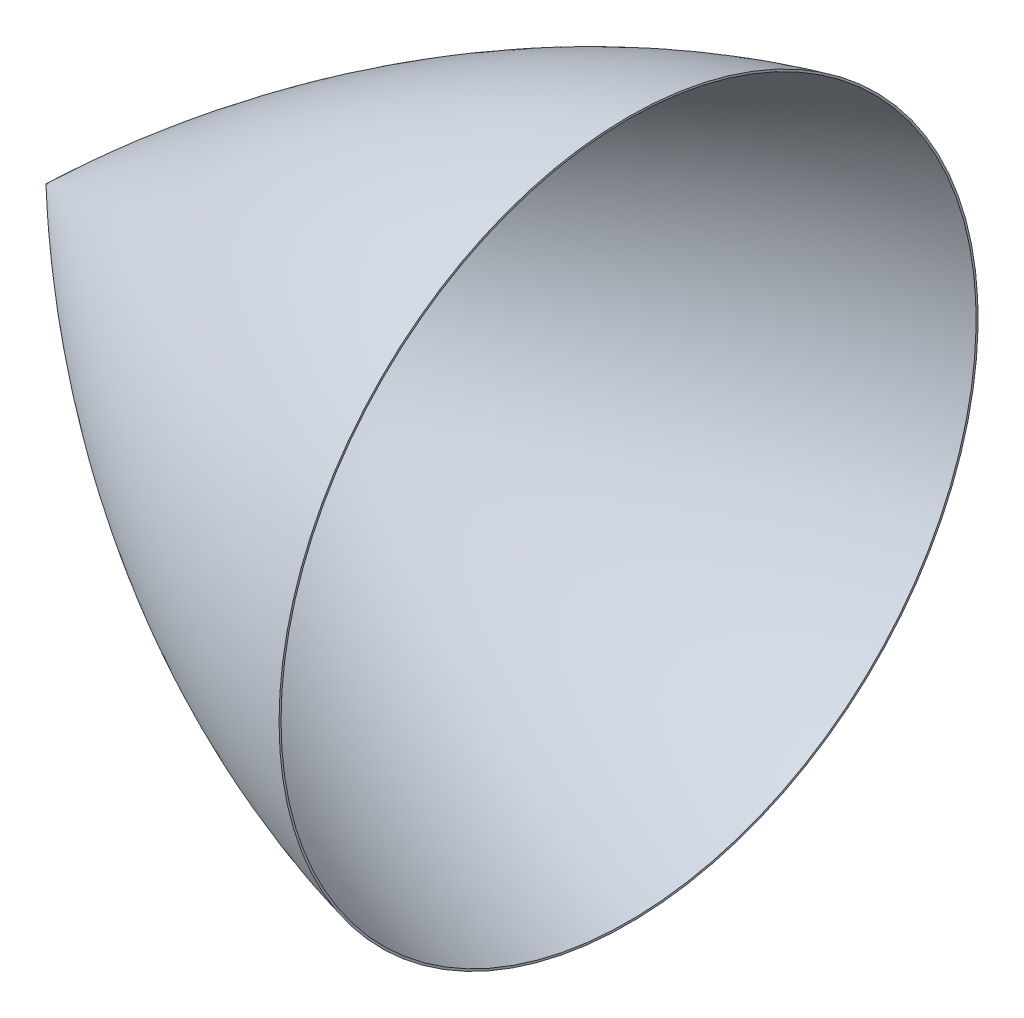
ISO-10303-21;
HEADER;
FILE_DESCRIPTION(('STEP AP214'),'2;1');
FILE_NAME('part.step','',(''),(''),'','','');
FILE_SCHEMA(('AUTOMOTIVE_DESIGN { 1 0 10303 214 1 1 1 1 }'));
ENDSEC;
DATA;
#1=APPLICATION_CONTEXT('core data for automotive mechanical design processes');
#2=APPLICATION_PROTOCOL_DEFINITION('international standard','automotive_design',2000,#1);
#3=PRODUCT_CONTEXT('',#1,'mechanical');
#4=PRODUCT('Part','Part','',(#3));
#5=PRODUCT_RELATED_PRODUCT_CATEGORY('part','',(#4));
#6=PRODUCT_DEFINITION_FORMATION('','',#4);
#7=PRODUCT_DEFINITION_CONTEXT('part definition',#1,'design');
#8=PRODUCT_DEFINITION('design','',#6,#7);
#9=PRODUCT_DEFINITION_SHAPE('','',#8);
#10=(LENGTH_UNIT() NAMED_UNIT(*) SI_UNIT(.MILLI.,.METRE.));
#11=(NAMED_UNIT(*) PLANE_ANGLE_UNIT() SI_UNIT($,.RADIAN.));
#12=(NAMED_UNIT(*) SI_UNIT($,.STERADIAN.) SOLID_ANGLE_UNIT());
#13=UNCERTAINTY_MEASURE_WITH_UNIT(LENGTH_MEASURE(1.E-05),#10,'distance_accuracy_value','');
#14=(GEOMETRIC_REPRESENTATION_CONTEXT(3) GLOBAL_UNCERTAINTY_ASSIGNED_CONTEXT((#13)) GLOBAL_UNIT_ASSIGNED_CONTEXT((#10,
#11,#12)) REPRESENTATION_CONTEXT('',''));
#15=CARTESIAN_POINT('',(0.,0.,0.));
#16=DIRECTION('',(0.,0.,1.));
#17=DIRECTION('',(1.,0.,0.));
#18=AXIS2_PLACEMENT_3D('',#15,#16,#17);
#19=CARTESIAN_POINT('',(7619.99999999521,0.,0.));
#20=DIRECTION('',(-1.,0.,0.));
#21=DIRECTION('',(0.,0.,1.));
#22=AXIS2_PLACEMENT_3D('',#19,#20,#21);
#23=PLANE('',#22);
#24=CARTESIAN_POINT('',(7619.99999999528,0.,0.));
#25=DIRECTION('',(-1.,0.,0.));
#26=DIRECTION('',(0.,0.,1.));
#27=AXIS2_PLACEMENT_3D('',#24,#25,#26);
#28=CIRCLE('',#27,4545.8767577942);
#29=CARTESIAN_POINT('',(7619.99999999528,0.,4545.8767577942));
#30=VERTEX_POINT('',#29);
#31=EDGE_CURVE('E46',#30,#30,#28,.T.);
#32=ORIENTED_EDGE('',*,*,#31,.T.);
#33=EDGE_LOOP('',(#32));
#34=FACE_BOUND('',#33,.T.);
#35=CARTESIAN_POINT('',(7619.99999999521,0.,0.));
#36=DIRECTION('',(-1.,0.,0.));
#37=DIRECTION('',(0.,0.,1.));
#38=AXIS2_PLACEMENT_3D('',#35,#36,#37);
#39=CIRCLE('',#38,4572.);
#40=CARTESIAN_POINT('',(7619.99999999521,0.,4572.));
#41=VERTEX_POINT('',#40);
#42=EDGE_CURVE('E11',#41,#41,#39,.T.);
#43=ORIENTED_EDGE('',*,*,#42,.F.);
#44=EDGE_LOOP('',(#43));
#45=FACE_BOUND('',#44,.T.);
#46=ADVANCED_FACE('F39',(#34,#45),#23,.F.);
#47=CARTESIAN_POINT('',(1.01347657407796E-10,9.72933347824889E-11,0.));
#48=CARTESIAN_POINT('',(1.87740134786748,1.80230529395431,0.));
#49=CARTESIAN_POINT('',(5.5244526539301,5.30222639472966,0.));
#50=CARTESIAN_POINT('',(14.1169653702769,13.5454195533115,0.));
#51=CARTESIAN_POINT('',(22.0000547897217,21.0981902356204,0.));
#52=CARTESIAN_POINT('',(33.5446059496773,32.1528246928488,0.));
#53=CARTESIAN_POINT('',(46.708752927163,44.7416001061948,0.));
#54=CARTESIAN_POINT('',(62.4544573584839,59.7785555314608,0.));
#55=CARTESIAN_POINT('',(80.247464828274,76.7394260742745,0.));
#56=CARTESIAN_POINT('',(98.1670521370055,93.7915154288754,0.));
#57=CARTESIAN_POINT('',(116.042598820677,110.770951283337,0.));
#58=CARTESIAN_POINT('',(138.440778852595,132.008778807169,0.));
#59=CARTESIAN_POINT('',(165.331937213061,157.445923634877,0.));
#60=CARTESIAN_POINT('',(205.73609333592,195.551446100835,0.));
#61=CARTESIAN_POINT('',(259.72476904635,246.224218395045,0.));
#62=CARTESIAN_POINT('',(322.893056261337,305.154619186948,0.));
#63=CARTESIAN_POINT('',(395.330018942636,372.236871871071,0.));
#64=CARTESIAN_POINT('',(468.015884271906,439.051317599152,0.));
#65=CARTESIAN_POINT('',(540.950720151817,505.592832232719,0.));
#66=CARTESIAN_POINT('',(614.136956836665,571.858500337153,0.));
#67=CARTESIAN_POINT('',(687.575555579447,637.843939225251,0.));
#68=CARTESIAN_POINT('',(761.268377960242,703.545567704155,0.));
#69=CARTESIAN_POINT('',(835.216769664103,768.959248033079,0.));
#70=CARTESIAN_POINT('',(909.422380671881,834.081073956153,0.));
#71=CARTESIAN_POINT('',(983.886674254546,898.906897859622,0.));
#72=CARTESIAN_POINT('',(1133.33575317751,1027.95831758016,0.));
#73=CARTESIAN_POINT('',(1321.67385467313,1187.4971391804,0.));
#74=CARTESIAN_POINT('',(1550.07598932804,1376.08879786686,0.));
#75=CARTESIAN_POINT('',(1800.75357842844,1576.39453771898,0.));
#76=CARTESIAN_POINT('',(1995.42410726054,1728.13949209819,0.));
#77=CARTESIAN_POINT('',(2172.09539122916,1862.80296231837,0.));
#78=CARTESIAN_POINT('',(2330.26515401322,1981.00871220136,0.));
#79=CARTESIAN_POINT('',(2489.57332050041,2097.67583412369,0.));
#80=CARTESIAN_POINT('',(2650.02924293696,2212.75955408681,0.));
#81=CARTESIAN_POINT('',(2811.64170311988,2326.21376290127,0.));
#82=CARTESIAN_POINT('',(2974.41868643201,2437.9908972045,0.));
#83=CARTESIAN_POINT('',(3138.36768573033,2548.04219087629,0.));
#84=CARTESIAN_POINT('',(3303.49527751566,2656.31743223421,0.));
#85=CARTESIAN_POINT('',(3491.92163639092,2776.91938159409,0.));
#86=CARTESIAN_POINT('',(3702.8978890566,2908.04217997174,0.));
#87=CARTESIAN_POINT('',(3937.05658063922,3048.57113731965,0.));
#88=CARTESIAN_POINT('',(4195.10534952983,3197.1672226111,0.));
#89=CARTESIAN_POINT('',(4454.48195194503,3340.2040699311,0.));
#90=CARTESIAN_POINT('',(4716.54224967053,3478.26494797615,0.));
#91=CARTESIAN_POINT('',(4981.26983493948,3611.14237076973,0.));
#92=CARTESIAN_POINT('',(5248.63892094148,3738.62410879923,0.));
#93=CARTESIAN_POINT('',(5518.61352060052,3860.49405812309,0.));
#94=CARTESIAN_POINT('',(5791.14648750829,3976.53322279501,0.));
#95=CARTESIAN_POINT('',(6066.17879880503,4086.52097738576,0.));
#96=CARTESIAN_POINT('',(6343.63869164902,4190.23643015886,0.));
#97=CARTESIAN_POINT('',(6588.46556626651,4275.30702321407,0.));
#98=CARTESIAN_POINT('',(6787.98281826292,4340.21389556613,0.));
#99=CARTESIAN_POINT('',(6929.4779090228,4383.93229610803,0.));
#100=CARTESIAN_POINT('',(7012.22154666975,4408.75863971695,0.));
#101=CARTESIAN_POINT('',(7071.42024270652,4426.1674364486,0.));
#102=CARTESIAN_POINT('',(7118.83618731631,4439.89892438963,0.));
#103=CARTESIAN_POINT('',(7166.30855851103,4453.43393704218,0.));
#104=CARTESIAN_POINT('',(7213.83677974541,4466.77155627866,0.));
#105=CARTESIAN_POINT('',(7261.42028906431,4479.9108730655,0.));
#106=CARTESIAN_POINT('',(7303.10357605428,4491.23343362137,0.));
#107=CARTESIAN_POINT('',(7338.86595752091,4500.81342912991,0.));
#108=CARTESIAN_POINT('',(7368.69003656812,4508.71304181715,0.));
#109=CARTESIAN_POINT('',(7392.56289350955,4514.98249065609,0.));
#110=CARTESIAN_POINT('',(7416.44828381828,4521.20135148719,0.));
#111=CARTESIAN_POINT('',(7440.34787298326,4527.36993347933,0.));
#112=CARTESIAN_POINT('',(7464.25854379477,4533.48739866174,0.));
#113=CARTESIAN_POINT('',(7488.18535193785,4539.5548712777,0.));
#114=CARTESIAN_POINT('',(7512.11940509445,4545.57012890112,0.));
#115=CARTESIAN_POINT('',(7533.08200574404,4550.79106594278,0.));
#116=CARTESIAN_POINT('',(7551.04286900422,4555.23062519298,0.));
#117=CARTESIAN_POINT('',(7566.04087019449,4558.91502495668,0.));
#118=CARTESIAN_POINT('',(7577.98815065165,4561.83671678102,0.));
#119=CARTESIAN_POINT('',(7588.57119988449,4564.4123265026,0.));
#120=CARTESIAN_POINT('',(7597.42410759232,4566.55911765531,0.));
#121=CARTESIAN_POINT('',(7604.18164795769,4568.19240168305,0.));
#122=CARTESIAN_POINT('',(7608.98379440809,4569.35044238275,0.));
#123=CARTESIAN_POINT('',(7613.80970477411,4570.51248672083,0.));
#124=CARTESIAN_POINT('',(7616.83342995595,4571.23959797744,0.));
#125=CARTESIAN_POINT('',(7618.73469301098,4571.69632632377,0.));
#126=CARTESIAN_POINT('',(7619.99999999523,4571.99999999999,0.));
#127=B_SPLINE_CURVE_WITH_KNOTS('',4,(#47,#48,#49,#50,#51,#52,#53,#54,#55,#56,#57,#58,#59,#60,
#61,#62,#63,#64,#65,#66,#67,#68,#69,#70,#71,#72,#73,#74,#75,#76,#77,#78,#79,#80,#81,#82,#83,#84,
#85,#86,#87,#88,#89,#90,#91,#92,#93,#94,#95,#96,#97,#98,#99,#100,#101,#102,#103,#104,#105,#106,
#107,#108,#109,#110,#111,#112,#113,#114,#115,#116,#117,#118,#119,#120,#121,#122,#123,#124,#125,
#126),.UNSPECIFIED.,.F.,.F.,(5,1,1,1,1,1,1,1,1,1,1,1,1,1,1,1,1,1,1,1,1,1,1,1,1,1,1,1,1,1,1,1,1,
1,1,1,1,1,1,1,1,1,1,1,1,1,1,1,1,1,1,1,1,1,1,1,1,1,1,1,1,1,1,1,1,1,1,1,1,1,1,1,1,1,1,1,5),
(0.0834980457108315,0.0846559203269954,0.0858137949431592,0.086971669559323,0.0881295441754869,
0.0904452934078145,0.0927610426401422,0.0950767918724698,0.0973925411047975,0.0997082903371252,
0.102024039569453,0.106655532026717,0.11128702448398,0.120550009398508,0.129812978245726,
0.139075947092944,0.148338934756868,0.157601922420792,0.166864908117926,0.176127893815061,
0.185390873525411,0.194653853235761,0.203916833911034,0.213179814586307,0.222442794179272,
0.268757694269802,0.296546618715655,0.32433557784179,0.342861538091348,0.3613874891421,
0.3799134344904,0.398439420103946,0.416965364680518,0.435491317107001,0.45401728312301,
0.472543239623733,0.491069208014046,0.509595182049545,0.537974754515422,0.565763707674729,
0.593552619712825,0.621341571792014,0.649130524853596,0.676919468746946,0.704708387151255,
0.73249733975273,0.760286295766909,0.788075221712798,0.81586413356906,0.843653094793508,
0.857547562742245,0.866810560631531,0.871442058355402,0.87607353986269,0.880705021369979,
0.885336501719254,0.88996798206853,0.894599477686182,0.899230973303835,0.901546723936096,
0.903862474568358,0.906178225200619,0.90849397583288,0.910809717042354,0.913125458251828,
0.915441199461301,0.917756940670775,0.920072679227726,0.921230548506201,0.922388417784676,
0.923546287063151,0.924704156341627,0.925283090980864,0.925862025620102,0.926151492939721,
0.92644096025934,0.927019894898577),.UNSPECIFIED.);
#128=CARTESIAN_POINT('',(0.,0.,0.));
#129=DIRECTION('',(-1.,0.,0.));
#130=AXIS1_PLACEMENT('',#128,#129);
#131=SURFACE_OF_REVOLUTION('',#127,#130);
#132=ORIENTED_EDGE('',*,*,#42,.T.);
#133=EDGE_LOOP('',(#132));
#134=FACE_BOUND('',#133,.T.);
#135=CARTESIAN_POINT('',(1.01347657407796E-10,9.72933347824889E-11,0.));
#136=VERTEX_POINT('',#135);
#137=VERTEX_LOOP('',#136);
#138=FACE_BOUND('',#137,.T.);
#139=ADVANCED_FACE('F55',(#134,#138),#131,.F.);
#140=CARTESIAN_POINT('',(19.1222361643196,18.340283029739,0.));
#141=CARTESIAN_POINT('',(20.9839847029081,20.1240964529545,0.));
#142=CARTESIAN_POINT('',(24.926165842535,23.9001132964018,0.));
#143=CARTESIAN_POINT('',(33.8380953384452,32.4334864028493,0.));
#144=CARTESIAN_POINT('',(46.708752927163,44.7416001061948,0.));
#145=CARTESIAN_POINT('',(62.4544573584839,59.7785555314608,0.));
#146=CARTESIAN_POINT('',(80.247464828274,76.7394260742745,0.));
#147=CARTESIAN_POINT('',(98.1670521370055,93.7915154288754,0.));
#148=CARTESIAN_POINT('',(116.042598820677,110.770951283337,0.));
#149=CARTESIAN_POINT('',(138.440778852595,132.008778807169,0.));
#150=CARTESIAN_POINT('',(165.331937213061,157.445923634877,0.));
#151=CARTESIAN_POINT('',(205.73609333592,195.551446100835,0.));
#152=CARTESIAN_POINT('',(259.72476904635,246.224218395045,0.));
#153=CARTESIAN_POINT('',(322.893056261337,305.154619186948,0.));
#154=CARTESIAN_POINT('',(395.330018942636,372.236871871071,0.));
#155=CARTESIAN_POINT('',(468.015884271906,439.051317599152,0.));
#156=CARTESIAN_POINT('',(540.950720151817,505.592832232719,0.));
#157=CARTESIAN_POINT('',(614.136956836665,571.858500337153,0.));
#158=CARTESIAN_POINT('',(687.575555579447,637.843939225251,0.));
#159=CARTESIAN_POINT('',(761.268377960242,703.545567704155,0.));
#160=CARTESIAN_POINT('',(835.216769664103,768.959248033079,0.));
#161=CARTESIAN_POINT('',(909.422380671881,834.081073956153,0.));
#162=CARTESIAN_POINT('',(983.886674254546,898.906897859622,0.));
#163=CARTESIAN_POINT('',(1133.33575317751,1027.95831758016,0.));
#164=CARTESIAN_POINT('',(1321.67385467313,1187.4971391804,0.));
#165=CARTESIAN_POINT('',(1550.07598932804,1376.08879786686,0.));
#166=CARTESIAN_POINT('',(1800.75357842844,1576.39453771898,0.));
#167=CARTESIAN_POINT('',(1995.42410726054,1728.13949209819,0.));
#168=CARTESIAN_POINT('',(2172.09539122916,1862.80296231837,0.));
#169=CARTESIAN_POINT('',(2330.26515401322,1981.00871220136,0.));
#170=CARTESIAN_POINT('',(2489.57332050041,2097.67583412369,0.));
#171=CARTESIAN_POINT('',(2650.02924293696,2212.75955408681,0.));
#172=CARTESIAN_POINT('',(2811.64170311988,2326.21376290127,0.));
#173=CARTESIAN_POINT('',(2974.41868643201,2437.9908972045,0.));
#174=CARTESIAN_POINT('',(3138.36768573033,2548.04219087629,0.));
#175=CARTESIAN_POINT('',(3303.49527751566,2656.31743223421,0.));
#176=CARTESIAN_POINT('',(3491.92163639092,2776.91938159409,0.));
#177=CARTESIAN_POINT('',(3702.8978890566,2908.04217997174,0.));
#178=CARTESIAN_POINT('',(3937.05658063922,3048.57113731965,0.));
#179=CARTESIAN_POINT('',(4195.10534952983,3197.1672226111,0.));
#180=CARTESIAN_POINT('',(4454.48195194503,3340.2040699311,0.));
#181=CARTESIAN_POINT('',(4716.54224967053,3478.26494797615,0.));
#182=CARTESIAN_POINT('',(4981.26983493948,3611.14237076973,0.));
#183=CARTESIAN_POINT('',(5248.63892094148,3738.62410879923,0.));
#184=CARTESIAN_POINT('',(5518.61352060052,3860.49405812309,0.));
#185=CARTESIAN_POINT('',(5791.14648750829,3976.53322279501,0.));
#186=CARTESIAN_POINT('',(6066.17879880503,4086.52097738576,0.));
#187=CARTESIAN_POINT('',(6343.63869164902,4190.23643015886,0.));
#188=CARTESIAN_POINT('',(6588.46556626651,4275.30702321407,0.));
#189=CARTESIAN_POINT('',(6787.98281826292,4340.21389556613,0.));
#190=CARTESIAN_POINT('',(6929.4779090228,4383.93229610803,0.));
#191=CARTESIAN_POINT('',(7012.22154666975,4408.75863971695,0.));
#192=CARTESIAN_POINT('',(7071.42024270652,4426.1674364486,0.));
#193=CARTESIAN_POINT('',(7118.83618731631,4439.89892438963,0.));
#194=CARTESIAN_POINT('',(7166.30855851103,4453.43393704218,0.));
#195=CARTESIAN_POINT('',(7213.83677974541,4466.77155627866,0.));
#196=CARTESIAN_POINT('',(7261.42028906431,4479.9108730655,0.));
#197=CARTESIAN_POINT('',(7303.10357605428,4491.23343362137,0.));
#198=CARTESIAN_POINT('',(7338.86595752091,4500.81342912991,0.));
#199=CARTESIAN_POINT('',(7368.69003656812,4508.71304181715,0.));
#200=CARTESIAN_POINT('',(7392.56289350955,4514.98249065609,0.));
#201=CARTESIAN_POINT('',(7416.44828381828,4521.20135148719,0.));
#202=CARTESIAN_POINT('',(7440.34787298326,4527.36993347933,0.));
#203=CARTESIAN_POINT('',(7464.25854379477,4533.48739866174,0.));
#204=CARTESIAN_POINT('',(7488.18535193785,4539.5548712777,0.));
#205=CARTESIAN_POINT('',(7512.11940509445,4545.57012890112,0.));
#206=CARTESIAN_POINT('',(7533.08200574404,4550.79106594278,0.));
#207=CARTESIAN_POINT('',(7551.04286900422,4555.23062519298,0.));
#208=CARTESIAN_POINT('',(7566.04087019449,4558.91502495668,0.));
#209=CARTESIAN_POINT('',(7577.98815065165,4561.83671678102,0.));
#210=CARTESIAN_POINT('',(7588.57119988449,4564.4123265026,0.));
#211=CARTESIAN_POINT('',(7597.42410759232,4566.55911765531,0.));
#212=CARTESIAN_POINT('',(7604.18164795769,4568.19240168305,0.));
#213=CARTESIAN_POINT('',(7608.98379440809,4569.35044238275,0.));
#214=CARTESIAN_POINT('',(7613.80970477411,4570.51248672083,0.));
#215=CARTESIAN_POINT('',(7616.83342995595,4571.23959797744,0.));
#216=CARTESIAN_POINT('',(7618.73469301098,4571.69632632377,0.));
#217=CARTESIAN_POINT('',(7619.99999999523,4571.99999999999,0.));
#218=B_SPLINE_CURVE_WITH_KNOTS('',4,(#140,#141,#142,#143,#144,#145,#146,#147,#148,#149,#150,
#151,#152,#153,#154,#155,#156,#157,#158,#159,#160,#161,#162,#163,#164,#165,#166,#167,#168,#169,
#170,#171,#172,#173,#174,#175,#176,#177,#178,#179,#180,#181,#182,#183,#184,#185,#186,#187,#188,
#189,#190,#191,#192,#193,#194,#195,#196,#197,#198,#199,#200,#201,#202,#203,#204,#205,#206,#207,
#208,#209,#210,#211,#212,#213,#214,#215,#216,#217),.UNSPECIFIED.,.F.,.F.,(5,1,1,1,1,1,1,1,1,1,1,
1,1,1,1,1,1,1,1,1,1,1,1,1,1,1,1,1,1,1,1,1,1,1,1,1,1,1,1,1,1,1,1,1,1,1,1,1,1,1,1,1,1,1,1,1,1,1,1,
1,1,1,1,1,1,1,1,1,1,1,1,1,1,1,5),(0.0859686810503786,0.086971669559323,0.0881295441754869,
0.0904452934078145,0.0927610426401422,0.0950767918724698,0.0973925411047975,0.0997082903371252,
0.102024039569453,0.106655532026717,0.11128702448398,0.120550009398508,0.129812978245726,
0.139075947092944,0.148338934756868,0.157601922420792,0.166864908117926,0.176127893815061,
0.185390873525411,0.194653853235761,0.203916833911034,0.213179814586307,0.222442794179272,
0.268757694269802,0.296546618715655,0.32433557784179,0.342861538091348,0.3613874891421,
0.3799134344904,0.398439420103946,0.416965364680518,0.435491317107001,0.45401728312301,
0.472543239623733,0.491069208014046,0.509595182049545,0.537974754515422,0.565763707674729,
0.593552619712825,0.621341571792014,0.649130524853596,0.676919468746946,0.704708387151255,
0.73249733975273,0.760286295766909,0.788075221712798,0.81586413356906,0.843653094793508,
0.857547562742245,0.866810560631531,0.871442058355402,0.87607353986269,0.880705021369979,
0.885336501719254,0.88996798206853,0.894599477686182,0.899230973303835,0.901546723936096,
0.903862474568358,0.906178225200619,0.90849397583288,0.910809717042354,0.913125458251828,
0.915441199461301,0.917756940670775,0.920072679227726,0.921230548506201,0.922388417784676,
0.923546287063151,0.924704156341627,0.925283090980864,0.925862025620102,0.926151492939721,
0.92644096025934,0.927019894898577),.UNSPECIFIED.);
#219=CARTESIAN_POINT('',(0.,0.,0.));
#220=DIRECTION('',(-1.,0.,0.));
#221=AXIS1_PLACEMENT('',#219,#220);
#222=SURFACE_OF_REVOLUTION('',#218,#221);
#223=OFFSET_SURFACE('',#222,25.4,.F.);
#224=CARTESIAN_POINT('',(36.6947720766193,0.,0.));
#225=VERTEX_POINT('',#224);
#226=VERTEX_LOOP('',#225);
#227=FACE_BOUND('',#226,.T.);
#228=ORIENTED_EDGE('',*,*,#31,.F.);
#229=EDGE_LOOP('',(#228));
#230=FACE_BOUND('',#229,.T.);
#231=ADVANCED_FACE('F52',(#227,#230),#223,.T.);
#232=CLOSED_SHELL('',(#46,#139,#231));
#233=MANIFOLD_SOLID_BREP('B2',#232);
#234=ADVANCED_BREP_SHAPE_REPRESENTATION('',(#18,#233),#14);
#235=SHAPE_DEFINITION_REPRESENTATION(#9,#234);
ENDSEC;
END-ISO-10303-21;
